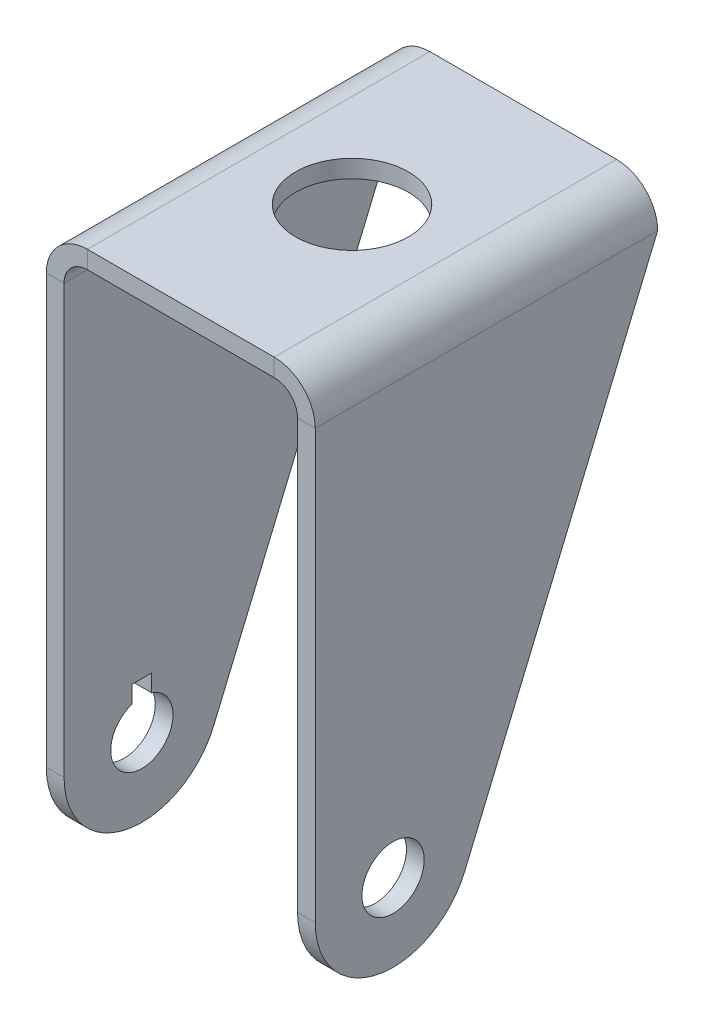
ISO-10303-21;
HEADER;
FILE_DESCRIPTION(('STEP AP214'),'2;1');
FILE_NAME('part.step','',(''),(''),'','','');
FILE_SCHEMA(('AUTOMOTIVE_DESIGN { 1 0 10303 214 1 1 1 1 }'));
ENDSEC;
DATA;
#1=APPLICATION_CONTEXT('core data for automotive mechanical design processes');
#2=APPLICATION_PROTOCOL_DEFINITION('international standard','automotive_design',2000,#1);
#3=PRODUCT_CONTEXT('',#1,'mechanical');
#4=PRODUCT('Part','Part','',(#3));
#5=PRODUCT_RELATED_PRODUCT_CATEGORY('part','',(#4));
#6=PRODUCT_DEFINITION_FORMATION('','',#4);
#7=PRODUCT_DEFINITION_CONTEXT('part definition',#1,'design');
#8=PRODUCT_DEFINITION('design','',#6,#7);
#9=PRODUCT_DEFINITION_SHAPE('','',#8);
#10=(LENGTH_UNIT() NAMED_UNIT(*) SI_UNIT(.MILLI.,.METRE.));
#11=(NAMED_UNIT(*) PLANE_ANGLE_UNIT() SI_UNIT($,.RADIAN.));
#12=(NAMED_UNIT(*) SI_UNIT($,.STERADIAN.) SOLID_ANGLE_UNIT());
#13=UNCERTAINTY_MEASURE_WITH_UNIT(LENGTH_MEASURE(1.E-05),#10,'distance_accuracy_value','');
#14=(GEOMETRIC_REPRESENTATION_CONTEXT(3) GLOBAL_UNCERTAINTY_ASSIGNED_CONTEXT((#13)) GLOBAL_UNIT_ASSIGNED_CONTEXT((#10,
#11,#12)) REPRESENTATION_CONTEXT('',''));
#15=CARTESIAN_POINT('',(0.,0.,0.));
#16=DIRECTION('',(0.,0.,1.));
#17=DIRECTION('',(1.,0.,0.));
#18=AXIS2_PLACEMENT_3D('',#15,#16,#17);
#19=CARTESIAN_POINT('',(15.,0.,22.));
#20=DIRECTION('',(1.,0.,0.));
#21=DIRECTION('',(0.,0.,-1.));
#22=AXIS2_PLACEMENT_3D('',#19,#20,#21);
#23=PLANE('',#22);
#24=CARTESIAN_POINT('',(15.,10.,12.));
#25=DIRECTION('',(1.,0.,0.));
#26=DIRECTION('',(0.,0.,-1.));
#27=AXIS2_PLACEMENT_3D('',#24,#25,#26);
#28=CIRCLE('',#27,4.);
#29=CARTESIAN_POINT('',(15.,10.,8.));
#30=VERTEX_POINT('',#29);
#31=EDGE_CURVE('E208',#30,#30,#28,.T.);
#32=ORIENTED_EDGE('',*,*,#31,.T.);
#33=EDGE_LOOP('',(#32));
#34=FACE_BOUND('',#33,.T.);
#35=CARTESIAN_POINT('',(15.,10.,12.));
#36=DIRECTION('',(1.,0.,0.));
#37=DIRECTION('',(0.,0.,-1.));
#38=AXIS2_PLACEMENT_3D('',#35,#36,#37);
#39=CIRCLE('',#38,10.);
#40=CARTESIAN_POINT('',(15.,6.1205166933722,2.78318876869032));
#41=VERTEX_POINT('',#40);
#42=CARTESIAN_POINT('',(15.,10.,22.));
#43=VERTEX_POINT('',#42);
#44=EDGE_CURVE('E251',#41,#43,#39,.F.);
#45=ORIENTED_EDGE('',*,*,#44,.T.);
#46=DIRECTION('',(0.,-1.,0.));
#47=VECTOR('',#46,1.);
#48=CARTESIAN_POINT('',(15.,0.,22.));
#49=LINE('',#48,#47);
#50=CARTESIAN_POINT('',(15.,65.,22.));
#51=VERTEX_POINT('',#50);
#52=EDGE_CURVE('E181',#51,#43,#49,.T.);
#53=ORIENTED_EDGE('',*,*,#52,.F.);
#54=DIRECTION('',(0.,0.,-1.));
#55=VECTOR('',#54,1.);
#56=CARTESIAN_POINT('',(15.,65.,22.));
#57=LINE('',#56,#55);
#58=CARTESIAN_POINT('',(15.,65.,-22.));
#59=VERTEX_POINT('',#58);
#60=EDGE_CURVE('E162',#51,#59,#57,.T.);
#61=ORIENTED_EDGE('',*,*,#60,.T.);
#62=DIRECTION('',(0.,-0.921681123130968,0.38794833066278));
#63=VECTOR('',#62,1.);
#64=CARTESIAN_POINT('',(15.,-5.95009076520798,7.86387437255124));
#65=LINE('',#64,#63);
#66=EDGE_CURVE('E254',#59,#41,#65,.T.);
#67=ORIENTED_EDGE('',*,*,#66,.T.);
#68=EDGE_LOOP('',(#45,#53,#61,#67));
#69=FACE_BOUND('',#68,.T.);
#70=ADVANCED_FACE('F47',(#34,#69),#23,.F.);
#71=CARTESIAN_POINT('',(17.278,0.,22.));
#72=DIRECTION('',(1.,0.,0.));
#73=DIRECTION('',(0.,0.,-1.));
#74=AXIS2_PLACEMENT_3D('',#71,#72,#73);
#75=PLANE('',#74);
#76=CARTESIAN_POINT('',(17.278,10.,12.));
#77=DIRECTION('',(1.,0.,0.));
#78=DIRECTION('',(0.,0.,-1.));
#79=AXIS2_PLACEMENT_3D('',#76,#77,#78);
#80=CIRCLE('',#79,4.);
#81=CARTESIAN_POINT('',(17.278,10.,8.));
#82=VERTEX_POINT('',#81);
#83=EDGE_CURVE('E219',#82,#82,#80,.T.);
#84=ORIENTED_EDGE('',*,*,#83,.F.);
#85=EDGE_LOOP('',(#84));
#86=FACE_BOUND('',#85,.T.);
#87=DIRECTION('',(0.,1.,0.));
#88=VECTOR('',#87,1.);
#89=CARTESIAN_POINT('',(17.278,0.,22.));
#90=LINE('',#89,#88);
#91=CARTESIAN_POINT('',(17.278,65.,22.));
#92=VERTEX_POINT('',#91);
#93=CARTESIAN_POINT('',(17.278,10.,22.));
#94=VERTEX_POINT('',#93);
#95=EDGE_CURVE('E265',#92,#94,#90,.F.);
#96=ORIENTED_EDGE('',*,*,#95,.T.);
#97=CARTESIAN_POINT('',(17.278,10.,12.));
#98=DIRECTION('',(1.,0.,0.));
#99=DIRECTION('',(0.,0.,-1.));
#100=AXIS2_PLACEMENT_3D('',#97,#98,#99);
#101=CIRCLE('',#100,10.);
#102=CARTESIAN_POINT('',(17.278,6.1205166933722,2.78318876869032));
#103=VERTEX_POINT('',#102);
#104=EDGE_CURVE('E257',#103,#94,#101,.F.);
#105=ORIENTED_EDGE('',*,*,#104,.F.);
#106=DIRECTION('',(0.,-0.921681123130968,0.38794833066278));
#107=VECTOR('',#106,1.);
#108=CARTESIAN_POINT('',(17.278,-5.95009076520798,7.86387437255124));
#109=LINE('',#108,#107);
#110=CARTESIAN_POINT('',(17.278,65.,-22.));
#111=VERTEX_POINT('',#110);
#112=EDGE_CURVE('E233',#111,#103,#109,.T.);
#113=ORIENTED_EDGE('',*,*,#112,.F.);
#114=DIRECTION('',(0.,0.,-1.));
#115=VECTOR('',#114,1.);
#116=CARTESIAN_POINT('',(17.278,65.,22.));
#117=LINE('',#116,#115);
#118=EDGE_CURVE('E195',#92,#111,#117,.T.);
#119=ORIENTED_EDGE('',*,*,#118,.F.);
#120=EDGE_LOOP('',(#96,#105,#113,#119));
#121=FACE_BOUND('',#120,.T.);
#122=ADVANCED_FACE('F379',(#86,#121),#75,.T.);
#123=CARTESIAN_POINT('',(-17.278,0.,22.));
#124=DIRECTION('',(-1.,0.,0.));
#125=DIRECTION('',(0.,0.,1.));
#126=AXIS2_PLACEMENT_3D('',#123,#124,#125);
#127=PLANE('',#126);
#128=DIRECTION('',(0.,1.,0.));
#129=VECTOR('',#128,1.);
#130=CARTESIAN_POINT('',(-17.278,0.,13.25));
#131=LINE('',#130,#129);
#132=CARTESIAN_POINT('',(-17.278,13.7996710383927,13.25));
#133=VERTEX_POINT('',#132);
#134=CARTESIAN_POINT('',(-17.278,16.,13.25));
#135=VERTEX_POINT('',#134);
#136=EDGE_CURVE('E358',#133,#135,#131,.T.);
#137=ORIENTED_EDGE('',*,*,#136,.F.);
#138=CARTESIAN_POINT('',(-17.278,10.,12.));
#139=DIRECTION('',(1.,0.,0.));
#140=DIRECTION('',(0.,0.,-1.));
#141=AXIS2_PLACEMENT_3D('',#138,#139,#140);
#142=CIRCLE('',#141,4.);
#143=CARTESIAN_POINT('',(-17.278,13.7996710383927,10.75));
#144=VERTEX_POINT('',#143);
#145=EDGE_CURVE('E209',#133,#144,#142,.T.);
#146=ORIENTED_EDGE('',*,*,#145,.T.);
#147=DIRECTION('',(0.,1.,0.));
#148=VECTOR('',#147,1.);
#149=CARTESIAN_POINT('',(-17.278,0.,10.75));
#150=LINE('',#149,#148);
#151=CARTESIAN_POINT('',(-17.278,16.,10.75));
#152=VERTEX_POINT('',#151);
#153=EDGE_CURVE('E64',#144,#152,#150,.T.);
#154=ORIENTED_EDGE('',*,*,#153,.T.);
#155=DIRECTION('',(0.,0.,-1.));
#156=VECTOR('',#155,1.);
#157=CARTESIAN_POINT('',(-17.278,16.,0.));
#158=LINE('',#157,#156);
#159=EDGE_CURVE('E348',#135,#152,#158,.T.);
#160=ORIENTED_EDGE('',*,*,#159,.F.);
#161=EDGE_LOOP('',(#137,#146,#154,#160));
#162=FACE_BOUND('',#161,.T.);
#163=DIRECTION('',(0.,0.,-1.));
#164=VECTOR('',#163,1.);
#165=CARTESIAN_POINT('',(-17.278,65.,22.));
#166=LINE('',#165,#164);
#167=CARTESIAN_POINT('',(-17.278,65.,22.));
#168=VERTEX_POINT('',#167);
#169=CARTESIAN_POINT('',(-17.278,65.,-22.));
#170=VERTEX_POINT('',#169);
#171=EDGE_CURVE('E186',#168,#170,#166,.T.);
#172=ORIENTED_EDGE('',*,*,#171,.T.);
#173=DIRECTION('',(0.,0.921681123130968,-0.38794833066278));
#174=VECTOR('',#173,1.);
#175=CARTESIAN_POINT('',(-17.278,-5.95009076520798,7.86387437255124));
#176=LINE('',#175,#174);
#177=CARTESIAN_POINT('',(-17.278,6.1205166933722,2.78318876869032));
#178=VERTEX_POINT('',#177);
#179=EDGE_CURVE('E235',#178,#170,#176,.T.);
#180=ORIENTED_EDGE('',*,*,#179,.F.);
#181=CARTESIAN_POINT('',(-17.278,10.,12.));
#182=DIRECTION('',(-1.,0.,0.));
#183=DIRECTION('',(0.,0.,1.));
#184=AXIS2_PLACEMENT_3D('',#181,#182,#183);
#185=CIRCLE('',#184,10.);
#186=CARTESIAN_POINT('',(-17.278,10.,22.));
#187=VERTEX_POINT('',#186);
#188=EDGE_CURVE('E245',#187,#178,#185,.F.);
#189=ORIENTED_EDGE('',*,*,#188,.F.);
#190=DIRECTION('',(0.,1.,0.));
#191=VECTOR('',#190,1.);
#192=CARTESIAN_POINT('',(-17.278,0.,22.));
#193=LINE('',#192,#191);
#194=EDGE_CURVE('E274',#187,#168,#193,.T.);
#195=ORIENTED_EDGE('',*,*,#194,.T.);
#196=EDGE_LOOP('',(#172,#180,#189,#195));
#197=FACE_BOUND('',#196,.T.);
#198=ADVANCED_FACE('F386',(#162,#197),#127,.T.);
#199=CARTESIAN_POINT('',(-15.,0.,22.));
#200=DIRECTION('',(-1.,0.,0.));
#201=DIRECTION('',(0.,0.,1.));
#202=AXIS2_PLACEMENT_3D('',#199,#200,#201);
#203=PLANE('',#202);
#204=CARTESIAN_POINT('',(-15.,10.,12.));
#205=DIRECTION('',(-1.,0.,0.));
#206=DIRECTION('',(0.,0.,1.));
#207=AXIS2_PLACEMENT_3D('',#204,#205,#206);
#208=CIRCLE('',#207,4.);
#209=CARTESIAN_POINT('',(-15.,13.7996710383927,10.75));
#210=VERTEX_POINT('',#209);
#211=CARTESIAN_POINT('',(-15.,13.7996710383927,13.25));
#212=VERTEX_POINT('',#211);
#213=EDGE_CURVE('E206',#210,#212,#208,.T.);
#214=ORIENTED_EDGE('',*,*,#213,.T.);
#215=DIRECTION('',(0.,-1.,0.));
#216=VECTOR('',#215,1.);
#217=CARTESIAN_POINT('',(-15.,0.,13.25));
#218=LINE('',#217,#216);
#219=CARTESIAN_POINT('',(-15.,16.,13.25));
#220=VERTEX_POINT('',#219);
#221=EDGE_CURVE('E362',#220,#212,#218,.T.);
#222=ORIENTED_EDGE('',*,*,#221,.F.);
#223=DIRECTION('',(0.,0.,1.));
#224=VECTOR('',#223,1.);
#225=CARTESIAN_POINT('',(-15.,16.,0.));
#226=LINE('',#225,#224);
#227=CARTESIAN_POINT('',(-15.,16.,10.75));
#228=VERTEX_POINT('',#227);
#229=EDGE_CURVE('E349',#228,#220,#226,.T.);
#230=ORIENTED_EDGE('',*,*,#229,.F.);
#231=DIRECTION('',(0.,-1.,0.));
#232=VECTOR('',#231,1.);
#233=CARTESIAN_POINT('',(-15.,0.,10.75));
#234=LINE('',#233,#232);
#235=EDGE_CURVE('E344',#228,#210,#234,.T.);
#236=ORIENTED_EDGE('',*,*,#235,.T.);
#237=EDGE_LOOP('',(#214,#222,#230,#236));
#238=FACE_BOUND('',#237,.T.);
#239=DIRECTION('',(0.,0.921681123130968,-0.38794833066278));
#240=VECTOR('',#239,1.);
#241=CARTESIAN_POINT('',(-15.,-5.95009076520798,7.86387437255124));
#242=LINE('',#241,#240);
#243=CARTESIAN_POINT('',(-15.,6.1205166933722,2.78318876869032));
#244=VERTEX_POINT('',#243);
#245=CARTESIAN_POINT('',(-15.,65.,-22.));
#246=VERTEX_POINT('',#245);
#247=EDGE_CURVE('E216',#244,#246,#242,.T.);
#248=ORIENTED_EDGE('',*,*,#247,.T.);
#249=DIRECTION('',(0.,0.,-1.));
#250=VECTOR('',#249,1.);
#251=CARTESIAN_POINT('',(-15.,65.,22.));
#252=LINE('',#251,#250);
#253=CARTESIAN_POINT('',(-15.,65.,22.));
#254=VERTEX_POINT('',#253);
#255=EDGE_CURVE('E154',#254,#246,#252,.T.);
#256=ORIENTED_EDGE('',*,*,#255,.F.);
#257=DIRECTION('',(0.,1.,0.));
#258=VECTOR('',#257,1.);
#259=CARTESIAN_POINT('',(-15.,0.,22.));
#260=LINE('',#259,#258);
#261=CARTESIAN_POINT('',(-15.,10.,22.));
#262=VERTEX_POINT('',#261);
#263=EDGE_CURVE('E145',#262,#254,#260,.T.);
#264=ORIENTED_EDGE('',*,*,#263,.F.);
#265=CARTESIAN_POINT('',(-15.,10.,12.));
#266=DIRECTION('',(-1.,0.,0.));
#267=DIRECTION('',(0.,0.,1.));
#268=AXIS2_PLACEMENT_3D('',#265,#266,#267);
#269=CIRCLE('',#268,10.);
#270=EDGE_CURVE('E242',#262,#244,#269,.F.);
#271=ORIENTED_EDGE('',*,*,#270,.T.);
#272=EDGE_LOOP('',(#248,#256,#264,#271));
#273=FACE_BOUND('',#272,.T.);
#274=ADVANCED_FACE('F282',(#238,#273),#203,.F.);
#275=CARTESIAN_POINT('',(12.,65.,22.));
#276=DIRECTION('',(0.,0.,1.));
#277=DIRECTION('',(1.,0.,0.));
#278=AXIS2_PLACEMENT_3D('',#275,#276,#277);
#279=PLANE('',#278);
#280=ORIENTED_EDGE('',*,*,#52,.T.);
#281=DIRECTION('',(-1.,0.,0.));
#282=VECTOR('',#281,1.);
#283=CARTESIAN_POINT('',(15.,10.,22.));
#284=LINE('',#283,#282);
#285=EDGE_CURVE('E230',#43,#94,#284,.F.);
#286=ORIENTED_EDGE('',*,*,#285,.T.);
#287=ORIENTED_EDGE('',*,*,#95,.F.);
#288=DIRECTION('',(-1.,0.,0.));
#289=VECTOR('',#288,1.);
#290=CARTESIAN_POINT('',(17.278,65.,22.));
#291=LINE('',#290,#289);
#292=EDGE_CURVE('E56',#92,#51,#291,.T.);
#293=ORIENTED_EDGE('',*,*,#292,.T.);
#294=EDGE_LOOP('',(#280,#286,#287,#293));
#295=FACE_BOUND('',#294,.T.);
#296=ADVANCED_FACE('F411',(#295),#279,.T.);
#297=CARTESIAN_POINT('',(12.,68.,22.));
#298=DIRECTION('',(0.,0.,1.));
#299=DIRECTION('',(1.,0.,0.));
#300=AXIS2_PLACEMENT_3D('',#297,#298,#299);
#301=PLANE('',#300);
#302=DIRECTION('',(0.,1.,0.));
#303=VECTOR('',#302,1.);
#304=CARTESIAN_POINT('',(12.,68.,22.));
#305=LINE('',#304,#303);
#306=CARTESIAN_POINT('',(12.,68.,22.));
#307=VERTEX_POINT('',#306);
#308=CARTESIAN_POINT('',(12.,70.278,22.));
#309=VERTEX_POINT('',#308);
#310=EDGE_CURVE('E11',#307,#309,#305,.T.);
#311=ORIENTED_EDGE('',*,*,#310,.F.);
#312=CARTESIAN_POINT('',(12.,65.,22.));
#313=DIRECTION('',(0.,0.,-1.));
#314=DIRECTION('',(-1.,0.,0.));
#315=AXIS2_PLACEMENT_3D('',#312,#313,#314);
#316=CIRCLE('',#315,3.);
#317=EDGE_CURVE('E160',#307,#51,#316,.T.);
#318=ORIENTED_EDGE('',*,*,#317,.T.);
#319=ORIENTED_EDGE('',*,*,#292,.F.);
#320=CARTESIAN_POINT('',(12.,65.,22.));
#321=DIRECTION('',(0.,0.,1.));
#322=DIRECTION('',(1.,0.,0.));
#323=AXIS2_PLACEMENT_3D('',#320,#321,#322);
#324=CIRCLE('',#323,5.278);
#325=EDGE_CURVE('E268',#309,#92,#324,.F.);
#326=ORIENTED_EDGE('',*,*,#325,.F.);
#327=EDGE_LOOP('',(#311,#318,#319,#326));
#328=FACE_BOUND('',#327,.T.);
#329=ADVANCED_FACE('F49',(#328),#301,.T.);
#330=CARTESIAN_POINT('',(17.278,65.,22.));
#331=DIRECTION('',(0.,0.,1.));
#332=DIRECTION('',(1.,0.,0.));
#333=AXIS2_PLACEMENT_3D('',#330,#331,#332);
#334=PLANE('',#333);
#335=DIRECTION('',(1.,0.,0.));
#336=VECTOR('',#335,1.);
#337=CARTESIAN_POINT('',(15.,68.,22.));
#338=LINE('',#337,#336);
#339=CARTESIAN_POINT('',(-12.,68.,22.));
#340=VERTEX_POINT('',#339);
#341=EDGE_CURVE('E125',#340,#307,#338,.T.);
#342=ORIENTED_EDGE('',*,*,#341,.T.);
#343=ORIENTED_EDGE('',*,*,#310,.T.);
#344=DIRECTION('',(1.,0.,0.));
#345=VECTOR('',#344,1.);
#346=CARTESIAN_POINT('',(15.,70.278,22.));
#347=LINE('',#346,#345);
#348=CARTESIAN_POINT('',(-12.,70.278,22.));
#349=VERTEX_POINT('',#348);
#350=EDGE_CURVE('E128',#349,#309,#347,.T.);
#351=ORIENTED_EDGE('',*,*,#350,.F.);
#352=DIRECTION('',(0.,-1.,0.));
#353=VECTOR('',#352,1.);
#354=CARTESIAN_POINT('',(-12.,70.278,22.));
#355=LINE('',#354,#353);
#356=EDGE_CURVE('E121',#349,#340,#355,.T.);
#357=ORIENTED_EDGE('',*,*,#356,.T.);
#358=EDGE_LOOP('',(#342,#343,#351,#357));
#359=FACE_BOUND('',#358,.T.);
#360=ADVANCED_FACE('F123',(#359),#334,.T.);
#361=CARTESIAN_POINT('',(15.,65.,-22.));
#362=DIRECTION('',(0.,0.,-1.));
#363=DIRECTION('',(-1.,0.,0.));
#364=AXIS2_PLACEMENT_3D('',#361,#362,#363);
#365=PLANE('',#364);
#366=DIRECTION('',(1.,0.,0.));
#367=VECTOR('',#366,1.);
#368=CARTESIAN_POINT('',(15.,65.,-22.));
#369=LINE('',#368,#367);
#370=EDGE_CURVE('E204',#59,#111,#369,.T.);
#371=ORIENTED_EDGE('',*,*,#370,.F.);
#372=CARTESIAN_POINT('',(12.,65.,-22.));
#373=DIRECTION('',(0.,0.,-1.));
#374=DIRECTION('',(-1.,0.,0.));
#375=AXIS2_PLACEMENT_3D('',#372,#373,#374);
#376=CIRCLE('',#375,3.);
#377=CARTESIAN_POINT('',(12.,68.,-22.));
#378=VERTEX_POINT('',#377);
#379=EDGE_CURVE('E178',#378,#59,#376,.T.);
#380=ORIENTED_EDGE('',*,*,#379,.F.);
#381=DIRECTION('',(0.,-1.,0.));
#382=VECTOR('',#381,1.);
#383=CARTESIAN_POINT('',(12.,70.278,-22.));
#384=LINE('',#383,#382);
#385=CARTESIAN_POINT('',(12.,70.278,-22.));
#386=VERTEX_POINT('',#385);
#387=EDGE_CURVE('E97',#386,#378,#384,.T.);
#388=ORIENTED_EDGE('',*,*,#387,.F.);
#389=CARTESIAN_POINT('',(12.,65.,-22.));
#390=DIRECTION('',(0.,0.,1.));
#391=DIRECTION('',(1.,0.,0.));
#392=AXIS2_PLACEMENT_3D('',#389,#390,#391);
#393=CIRCLE('',#392,5.278);
#394=EDGE_CURVE('E166',#386,#111,#393,.F.);
#395=ORIENTED_EDGE('',*,*,#394,.T.);
#396=EDGE_LOOP('',(#371,#380,#388,#395));
#397=FACE_BOUND('',#396,.T.);
#398=ADVANCED_FACE('F404',(#397),#365,.T.);
#399=CARTESIAN_POINT('',(-15.,65.,22.));
#400=DIRECTION('',(0.,0.,1.));
#401=DIRECTION('',(1.,0.,0.));
#402=AXIS2_PLACEMENT_3D('',#399,#400,#401);
#403=PLANE('',#402);
#404=DIRECTION('',(-1.,0.,0.));
#405=VECTOR('',#404,1.);
#406=CARTESIAN_POINT('',(-15.,65.,22.));
#407=LINE('',#406,#405);
#408=EDGE_CURVE('E133',#254,#168,#407,.T.);
#409=ORIENTED_EDGE('',*,*,#408,.F.);
#410=CARTESIAN_POINT('',(-12.,65.,22.));
#411=DIRECTION('',(0.,0.,-1.));
#412=DIRECTION('',(-1.,0.,0.));
#413=AXIS2_PLACEMENT_3D('',#410,#411,#412);
#414=CIRCLE('',#413,3.);
#415=EDGE_CURVE('E138',#254,#340,#414,.T.);
#416=ORIENTED_EDGE('',*,*,#415,.T.);
#417=ORIENTED_EDGE('',*,*,#356,.F.);
#418=CARTESIAN_POINT('',(-12.,65.,22.));
#419=DIRECTION('',(0.,0.,1.));
#420=DIRECTION('',(1.,0.,0.));
#421=AXIS2_PLACEMENT_3D('',#418,#419,#420);
#422=CIRCLE('',#421,5.278);
#423=EDGE_CURVE('E272',#168,#349,#422,.F.);
#424=ORIENTED_EDGE('',*,*,#423,.F.);
#425=EDGE_LOOP('',(#409,#416,#417,#424));
#426=FACE_BOUND('',#425,.T.);
#427=ADVANCED_FACE('F140',(#426),#403,.T.);
#428=CARTESIAN_POINT('',(-12.,70.278,22.));
#429=DIRECTION('',(0.,0.,1.));
#430=DIRECTION('',(1.,0.,0.));
#431=AXIS2_PLACEMENT_3D('',#428,#429,#430);
#432=PLANE('',#431);
#433=DIRECTION('',(-1.,0.,0.));
#434=VECTOR('',#433,1.);
#435=CARTESIAN_POINT('',(-17.278,10.,22.));
#436=LINE('',#435,#434);
#437=EDGE_CURVE('E170',#187,#262,#436,.F.);
#438=ORIENTED_EDGE('',*,*,#437,.T.);
#439=ORIENTED_EDGE('',*,*,#263,.T.);
#440=ORIENTED_EDGE('',*,*,#408,.T.);
#441=ORIENTED_EDGE('',*,*,#194,.F.);
#442=EDGE_LOOP('',(#438,#439,#440,#441));
#443=FACE_BOUND('',#442,.T.);
#444=ADVANCED_FACE('F277',(#443),#432,.T.);
#445=CARTESIAN_POINT('',(-12.,68.,-22.));
#446=DIRECTION('',(0.,0.,-1.));
#447=DIRECTION('',(-1.,0.,0.));
#448=AXIS2_PLACEMENT_3D('',#445,#446,#447);
#449=PLANE('',#448);
#450=DIRECTION('',(0.,1.,0.));
#451=VECTOR('',#450,1.);
#452=CARTESIAN_POINT('',(-12.,68.,-22.));
#453=LINE('',#452,#451);
#454=CARTESIAN_POINT('',(-12.,68.,-22.));
#455=VERTEX_POINT('',#454);
#456=CARTESIAN_POINT('',(-12.,70.278,-22.));
#457=VERTEX_POINT('',#456);
#458=EDGE_CURVE('E134',#455,#457,#453,.T.);
#459=ORIENTED_EDGE('',*,*,#458,.F.);
#460=CARTESIAN_POINT('',(-12.,65.,-22.));
#461=DIRECTION('',(0.,0.,-1.));
#462=DIRECTION('',(-1.,0.,0.));
#463=AXIS2_PLACEMENT_3D('',#460,#461,#462);
#464=CIRCLE('',#463,3.);
#465=EDGE_CURVE('E152',#246,#455,#464,.T.);
#466=ORIENTED_EDGE('',*,*,#465,.F.);
#467=DIRECTION('',(1.,0.,0.));
#468=VECTOR('',#467,1.);
#469=CARTESIAN_POINT('',(-17.278,65.,-22.));
#470=LINE('',#469,#468);
#471=EDGE_CURVE('E198',#170,#246,#470,.T.);
#472=ORIENTED_EDGE('',*,*,#471,.F.);
#473=CARTESIAN_POINT('',(-12.,65.,-22.));
#474=DIRECTION('',(0.,0.,1.));
#475=DIRECTION('',(1.,0.,0.));
#476=AXIS2_PLACEMENT_3D('',#473,#474,#475);
#477=CIRCLE('',#476,5.278);
#478=EDGE_CURVE('E172',#170,#457,#477,.F.);
#479=ORIENTED_EDGE('',*,*,#478,.T.);
#480=EDGE_LOOP('',(#459,#466,#472,#479));
#481=FACE_BOUND('',#480,.T.);
#482=ADVANCED_FACE('F396',(#481),#449,.T.);
#483=CARTESIAN_POINT('',(-17.278,65.,-22.));
#484=DIRECTION('',(0.,0.,-1.));
#485=DIRECTION('',(-1.,0.,0.));
#486=AXIS2_PLACEMENT_3D('',#483,#484,#485);
#487=PLANE('',#486);
#488=DIRECTION('',(1.,0.,0.));
#489=VECTOR('',#488,1.);
#490=CARTESIAN_POINT('',(15.,68.,-22.));
#491=LINE('',#490,#489);
#492=EDGE_CURVE('E176',#455,#378,#491,.T.);
#493=ORIENTED_EDGE('',*,*,#492,.F.);
#494=ORIENTED_EDGE('',*,*,#458,.T.);
#495=DIRECTION('',(1.,0.,0.));
#496=VECTOR('',#495,1.);
#497=CARTESIAN_POINT('',(15.,70.278,-22.));
#498=LINE('',#497,#496);
#499=EDGE_CURVE('E169',#457,#386,#498,.T.);
#500=ORIENTED_EDGE('',*,*,#499,.T.);
#501=ORIENTED_EDGE('',*,*,#387,.T.);
#502=EDGE_LOOP('',(#493,#494,#500,#501));
#503=FACE_BOUND('',#502,.T.);
#504=ADVANCED_FACE('F392',(#503),#487,.T.);
#505=CARTESIAN_POINT('',(12.,65.,22.));
#506=DIRECTION('',(0.,0.,-1.));
#507=DIRECTION('',(-1.,0.,0.));
#508=AXIS2_PLACEMENT_3D('',#505,#506,#507);
#509=CYLINDRICAL_SURFACE('',#508,5.278);
#510=ORIENTED_EDGE('',*,*,#394,.F.);
#511=DIRECTION('',(0.,0.,-1.));
#512=VECTOR('',#511,1.);
#513=CARTESIAN_POINT('',(12.,70.278,22.));
#514=LINE('',#513,#512);
#515=EDGE_CURVE('E192',#309,#386,#514,.T.);
#516=ORIENTED_EDGE('',*,*,#515,.F.);
#517=ORIENTED_EDGE('',*,*,#325,.T.);
#518=ORIENTED_EDGE('',*,*,#118,.T.);
#519=EDGE_LOOP('',(#510,#516,#517,#518));
#520=FACE_BOUND('',#519,.T.);
#521=ADVANCED_FACE('F395',(#520),#509,.T.);
#522=CARTESIAN_POINT('',(15.,70.278,22.));
#523=DIRECTION('',(0.,1.,0.));
#524=DIRECTION('',(0.,0.,1.));
#525=AXIS2_PLACEMENT_3D('',#522,#523,#524);
#526=PLANE('',#525);
#527=CARTESIAN_POINT('',(0.,70.278,0.));
#528=DIRECTION('',(0.,1.,0.));
#529=DIRECTION('',(0.,0.,1.));
#530=AXIS2_PLACEMENT_3D('',#527,#528,#529);
#531=CIRCLE('',#530,7.25);
#532=CARTESIAN_POINT('',(0.,70.278,7.25));
#533=VERTEX_POINT('',#532);
#534=EDGE_CURVE('E227',#533,#533,#531,.T.);
#535=ORIENTED_EDGE('',*,*,#534,.F.);
#536=EDGE_LOOP('',(#535));
#537=FACE_BOUND('',#536,.T.);
#538=ORIENTED_EDGE('',*,*,#499,.F.);
#539=DIRECTION('',(0.,0.,-1.));
#540=VECTOR('',#539,1.);
#541=CARTESIAN_POINT('',(-12.,70.278,22.));
#542=LINE('',#541,#540);
#543=EDGE_CURVE('E189',#349,#457,#542,.T.);
#544=ORIENTED_EDGE('',*,*,#543,.F.);
#545=ORIENTED_EDGE('',*,*,#350,.T.);
#546=ORIENTED_EDGE('',*,*,#515,.T.);
#547=EDGE_LOOP('',(#538,#544,#545,#546));
#548=FACE_BOUND('',#547,.T.);
#549=ADVANCED_FACE('F422',(#537,#548),#526,.T.);
#550=CARTESIAN_POINT('',(-12.,65.,22.));
#551=DIRECTION('',(0.,0.,-1.));
#552=DIRECTION('',(-1.,0.,0.));
#553=AXIS2_PLACEMENT_3D('',#550,#551,#552);
#554=CYLINDRICAL_SURFACE('',#553,5.278);
#555=ORIENTED_EDGE('',*,*,#478,.F.);
#556=ORIENTED_EDGE('',*,*,#171,.F.);
#557=ORIENTED_EDGE('',*,*,#423,.T.);
#558=ORIENTED_EDGE('',*,*,#543,.T.);
#559=EDGE_LOOP('',(#555,#556,#557,#558));
#560=FACE_BOUND('',#559,.T.);
#561=ADVANCED_FACE('F425',(#560),#554,.T.);
#562=CARTESIAN_POINT('',(-12.,65.,22.));
#563=DIRECTION('',(0.,0.,-1.));
#564=DIRECTION('',(-1.,0.,0.));
#565=AXIS2_PLACEMENT_3D('',#562,#563,#564);
#566=CYLINDRICAL_SURFACE('',#565,3.);
#567=ORIENTED_EDGE('',*,*,#465,.T.);
#568=DIRECTION('',(0.,0.,-1.));
#569=VECTOR('',#568,1.);
#570=CARTESIAN_POINT('',(-12.,68.,22.));
#571=LINE('',#570,#569);
#572=EDGE_CURVE('E149',#340,#455,#571,.T.);
#573=ORIENTED_EDGE('',*,*,#572,.F.);
#574=ORIENTED_EDGE('',*,*,#415,.F.);
#575=ORIENTED_EDGE('',*,*,#255,.T.);
#576=EDGE_LOOP('',(#567,#573,#574,#575));
#577=FACE_BOUND('',#576,.T.);
#578=ADVANCED_FACE('F150',(#577),#566,.F.);
#579=CARTESIAN_POINT('',(15.,68.,22.));
#580=DIRECTION('',(0.,1.,0.));
#581=DIRECTION('',(0.,0.,1.));
#582=AXIS2_PLACEMENT_3D('',#579,#580,#581);
#583=PLANE('',#582);
#584=CARTESIAN_POINT('',(0.,68.,0.));
#585=DIRECTION('',(0.,1.,0.));
#586=DIRECTION('',(0.,0.,1.));
#587=AXIS2_PLACEMENT_3D('',#584,#585,#586);
#588=CIRCLE('',#587,7.25);
#589=CARTESIAN_POINT('',(0.,68.,7.25));
#590=VERTEX_POINT('',#589);
#591=EDGE_CURVE('E51',#590,#590,#588,.T.);
#592=ORIENTED_EDGE('',*,*,#591,.T.);
#593=EDGE_LOOP('',(#592));
#594=FACE_BOUND('',#593,.T.);
#595=ORIENTED_EDGE('',*,*,#492,.T.);
#596=DIRECTION('',(0.,0.,-1.));
#597=VECTOR('',#596,1.);
#598=CARTESIAN_POINT('',(12.,68.,22.));
#599=LINE('',#598,#597);
#600=EDGE_CURVE('E155',#307,#378,#599,.T.);
#601=ORIENTED_EDGE('',*,*,#600,.F.);
#602=ORIENTED_EDGE('',*,*,#341,.F.);
#603=ORIENTED_EDGE('',*,*,#572,.T.);
#604=EDGE_LOOP('',(#595,#601,#602,#603));
#605=FACE_BOUND('',#604,.T.);
#606=ADVANCED_FACE('F157',(#594,#605),#583,.F.);
#607=CARTESIAN_POINT('',(12.,65.,22.));
#608=DIRECTION('',(0.,0.,-1.));
#609=DIRECTION('',(-1.,0.,0.));
#610=AXIS2_PLACEMENT_3D('',#607,#608,#609);
#611=CYLINDRICAL_SURFACE('',#610,3.);
#612=ORIENTED_EDGE('',*,*,#379,.T.);
#613=ORIENTED_EDGE('',*,*,#60,.F.);
#614=ORIENTED_EDGE('',*,*,#317,.F.);
#615=ORIENTED_EDGE('',*,*,#600,.T.);
#616=EDGE_LOOP('',(#612,#613,#614,#615));
#617=FACE_BOUND('',#616,.T.);
#618=ADVANCED_FACE('F433',(#617),#611,.F.);
#619=CARTESIAN_POINT('',(-17.278,10.,12.));
#620=DIRECTION('',(-1.,0.,0.));
#621=DIRECTION('',(0.,0.,1.));
#622=AXIS2_PLACEMENT_3D('',#619,#620,#621);
#623=CYLINDRICAL_SURFACE('',#622,10.);
#624=ORIENTED_EDGE('',*,*,#188,.T.);
#625=DIRECTION('',(1.,0.,0.));
#626=VECTOR('',#625,1.);
#627=CARTESIAN_POINT('',(-15.,6.1205166933722,2.78318876869032));
#628=LINE('',#627,#626);
#629=EDGE_CURVE('E234',#244,#178,#628,.F.);
#630=ORIENTED_EDGE('',*,*,#629,.F.);
#631=ORIENTED_EDGE('',*,*,#270,.F.);
#632=ORIENTED_EDGE('',*,*,#437,.F.);
#633=EDGE_LOOP('',(#624,#630,#631,#632));
#634=FACE_BOUND('',#633,.T.);
#635=ADVANCED_FACE('F429',(#634),#623,.T.);
#636=CARTESIAN_POINT('',(17.278,10.,12.));
#637=DIRECTION('',(1.,0.,0.));
#638=DIRECTION('',(0.,0.,-1.));
#639=AXIS2_PLACEMENT_3D('',#636,#637,#638);
#640=CYLINDRICAL_SURFACE('',#639,10.);
#641=DIRECTION('',(1.,0.,0.));
#642=VECTOR('',#641,1.);
#643=CARTESIAN_POINT('',(17.278,6.1205166933722,2.78318876869032));
#644=LINE('',#643,#642);
#645=EDGE_CURVE('E248',#103,#41,#644,.F.);
#646=ORIENTED_EDGE('',*,*,#645,.F.);
#647=ORIENTED_EDGE('',*,*,#104,.T.);
#648=ORIENTED_EDGE('',*,*,#285,.F.);
#649=ORIENTED_EDGE('',*,*,#44,.F.);
#650=EDGE_LOOP('',(#646,#647,#648,#649));
#651=FACE_BOUND('',#650,.T.);
#652=ADVANCED_FACE('F437',(#651),#640,.T.);
#653=CARTESIAN_POINT('',(17.278,-5.95009076520798,7.86387437255124));
#654=DIRECTION('',(0.,0.38794833066278,0.921681123130968));
#655=DIRECTION('',(0.,-0.921681123130968,0.38794833066278));
#656=AXIS2_PLACEMENT_3D('',#653,#654,#655);
#657=PLANE('',#656);
#658=ORIENTED_EDGE('',*,*,#112,.T.);
#659=ORIENTED_EDGE('',*,*,#645,.T.);
#660=ORIENTED_EDGE('',*,*,#66,.F.);
#661=ORIENTED_EDGE('',*,*,#370,.T.);
#662=EDGE_LOOP('',(#658,#659,#660,#661));
#663=FACE_BOUND('',#662,.T.);
#664=ADVANCED_FACE('F434',(#663),#657,.F.);
#665=CARTESIAN_POINT('',(-15.,-5.95009076520798,7.86387437255124));
#666=DIRECTION('',(0.,0.38794833066278,0.921681123130968));
#667=DIRECTION('',(0.,0.921681123130968,-0.38794833066278));
#668=AXIS2_PLACEMENT_3D('',#665,#666,#667);
#669=PLANE('',#668);
#670=ORIENTED_EDGE('',*,*,#471,.T.);
#671=ORIENTED_EDGE('',*,*,#247,.F.);
#672=ORIENTED_EDGE('',*,*,#629,.T.);
#673=ORIENTED_EDGE('',*,*,#179,.T.);
#674=EDGE_LOOP('',(#670,#671,#672,#673));
#675=FACE_BOUND('',#674,.T.);
#676=ADVANCED_FACE('F430',(#675),#669,.F.);
#677=CARTESIAN_POINT('',(-17.278,10.,12.));
#678=DIRECTION('',(1.,0.,0.));
#679=DIRECTION('',(0.,0.,-1.));
#680=AXIS2_PLACEMENT_3D('',#677,#678,#679);
#681=CYLINDRICAL_SURFACE('',#680,4.);
#682=ORIENTED_EDGE('',*,*,#145,.F.);
#683=DIRECTION('',(-1.,0.,0.));
#684=VECTOR('',#683,1.);
#685=CARTESIAN_POINT('',(17.2790000000001,13.7996710383927,13.25));
#686=LINE('',#685,#684);
#687=EDGE_CURVE('E347',#212,#133,#686,.T.);
#688=ORIENTED_EDGE('',*,*,#687,.F.);
#689=ORIENTED_EDGE('',*,*,#213,.F.);
#690=DIRECTION('',(-1.,0.,0.));
#691=VECTOR('',#690,1.);
#692=CARTESIAN_POINT('',(17.2790000000001,13.7996710383927,10.75));
#693=LINE('',#692,#691);
#694=EDGE_CURVE('E342',#210,#144,#693,.T.);
#695=ORIENTED_EDGE('',*,*,#694,.T.);
#696=EDGE_LOOP('',(#682,#688,#689,#695));
#697=FACE_BOUND('',#696,.T.);
#698=ADVANCED_FACE('F352',(#697),#681,.F.);
#699=ORIENTED_EDGE('',*,*,#83,.T.);
#700=EDGE_LOOP('',(#699));
#701=FACE_BOUND('',#700,.T.);
#702=ORIENTED_EDGE('',*,*,#31,.F.);
#703=EDGE_LOOP('',(#702));
#704=FACE_BOUND('',#703,.T.);
#705=ADVANCED_FACE('F374',(#701,#704),#681,.F.);
#706=CARTESIAN_POINT('',(0.,0.,0.));
#707=DIRECTION('',(0.,1.,0.));
#708=DIRECTION('',(0.,0.,1.));
#709=AXIS2_PLACEMENT_3D('',#706,#707,#708);
#710=CYLINDRICAL_SURFACE('',#709,7.25);
#711=ORIENTED_EDGE('',*,*,#534,.T.);
#712=EDGE_LOOP('',(#711));
#713=FACE_BOUND('',#712,.T.);
#714=ORIENTED_EDGE('',*,*,#591,.F.);
#715=EDGE_LOOP('',(#714));
#716=FACE_BOUND('',#715,.T.);
#717=ADVANCED_FACE('F366',(#713,#716),#710,.F.);
#718=CARTESIAN_POINT('',(17.2790000000001,0.,13.25));
#719=DIRECTION('',(0.,0.,1.));
#720=DIRECTION('',(0.,-1.,0.));
#721=AXIS2_PLACEMENT_3D('',#718,#719,#720);
#722=PLANE('',#721);
#723=ORIENTED_EDGE('',*,*,#221,.T.);
#724=ORIENTED_EDGE('',*,*,#687,.T.);
#725=ORIENTED_EDGE('',*,*,#136,.T.);
#726=DIRECTION('',(-1.,0.,0.));
#727=VECTOR('',#726,1.);
#728=CARTESIAN_POINT('',(17.2790000000001,16.,13.25));
#729=LINE('',#728,#727);
#730=EDGE_CURVE('E331',#220,#135,#729,.T.);
#731=ORIENTED_EDGE('',*,*,#730,.F.);
#732=EDGE_LOOP('',(#723,#724,#725,#731));
#733=FACE_BOUND('',#732,.T.);
#734=ADVANCED_FACE('F363',(#733),#722,.F.);
#735=CARTESIAN_POINT('',(17.2790000000001,16.,0.));
#736=DIRECTION('',(0.,1.,0.));
#737=DIRECTION('',(0.,0.,1.));
#738=AXIS2_PLACEMENT_3D('',#735,#736,#737);
#739=PLANE('',#738);
#740=ORIENTED_EDGE('',*,*,#229,.T.);
#741=ORIENTED_EDGE('',*,*,#730,.T.);
#742=ORIENTED_EDGE('',*,*,#159,.T.);
#743=DIRECTION('',(-1.,0.,0.));
#744=VECTOR('',#743,1.);
#745=CARTESIAN_POINT('',(17.2790000000001,16.,10.75));
#746=LINE('',#745,#744);
#747=EDGE_CURVE('E324',#228,#152,#746,.T.);
#748=ORIENTED_EDGE('',*,*,#747,.F.);
#749=EDGE_LOOP('',(#740,#741,#742,#748));
#750=FACE_BOUND('',#749,.T.);
#751=ADVANCED_FACE('F365',(#750),#739,.F.);
#752=CARTESIAN_POINT('',(17.2790000000001,0.,10.75));
#753=DIRECTION('',(0.,0.,1.));
#754=DIRECTION('',(1.,0.,0.));
#755=AXIS2_PLACEMENT_3D('',#752,#753,#754);
#756=PLANE('',#755);
#757=ORIENTED_EDGE('',*,*,#747,.T.);
#758=ORIENTED_EDGE('',*,*,#153,.F.);
#759=ORIENTED_EDGE('',*,*,#694,.F.);
#760=ORIENTED_EDGE('',*,*,#235,.F.);
#761=EDGE_LOOP('',(#757,#758,#759,#760));
#762=FACE_BOUND('',#761,.T.);
#763=ADVANCED_FACE('F343',(#762),#756,.T.);
#764=CLOSED_SHELL('',(#70,#122,#198,#274,#296,#329,#360,#398,#427,#444,#482,#504,#521,#549,#561,
#578,#606,#618,#635,#652,#664,#676,#698,#705,#717,#734,#751,#763));
#765=MANIFOLD_SOLID_BREP('B2',#764);
#766=ADVANCED_BREP_SHAPE_REPRESENTATION('',(#18,#765),#14);
#767=SHAPE_DEFINITION_REPRESENTATION(#9,#766);
ENDSEC;
END-ISO-10303-21;
